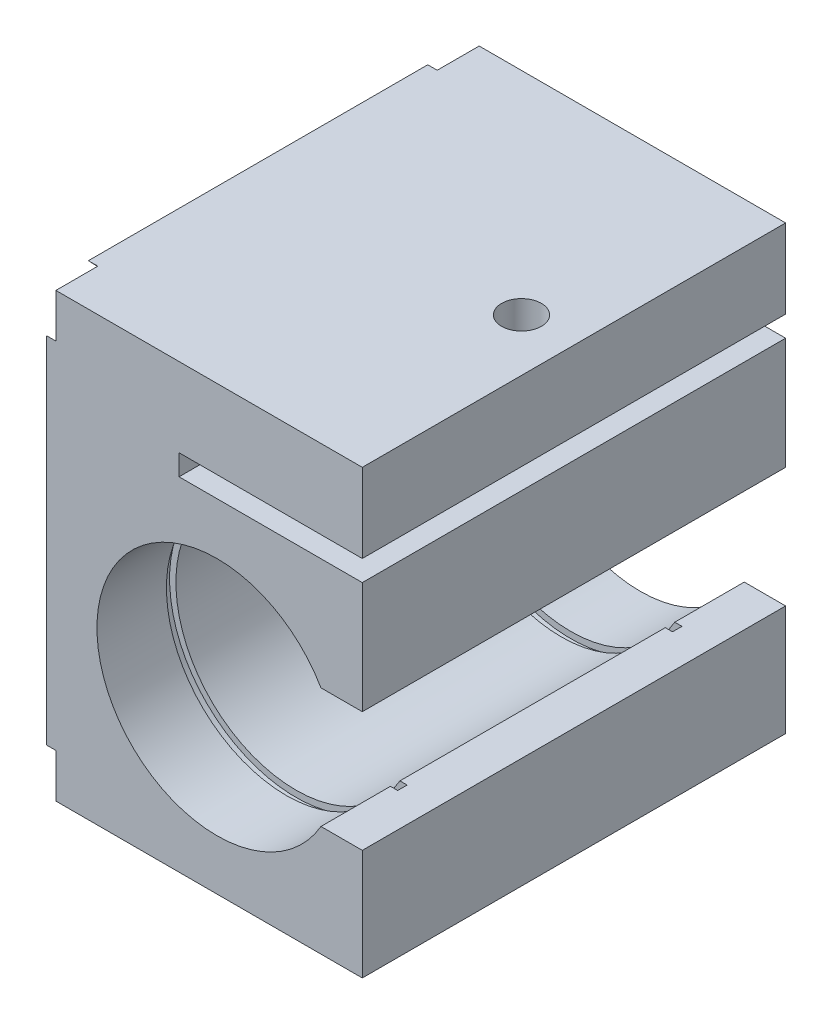
ISO-10303-21;
HEADER;
FILE_DESCRIPTION(('STEP AP214'),'2;1');
FILE_NAME('part.step','',(''),(''),'','','');
FILE_SCHEMA(('AUTOMOTIVE_DESIGN { 1 0 10303 214 1 1 1 1 }'));
ENDSEC;
DATA;
#1=APPLICATION_CONTEXT('core data for automotive mechanical design processes');
#2=APPLICATION_PROTOCOL_DEFINITION('international standard','automotive_design',2000,#1);
#3=PRODUCT_CONTEXT('',#1,'mechanical');
#4=PRODUCT('Part','Part','',(#3));
#5=PRODUCT_RELATED_PRODUCT_CATEGORY('part','',(#4));
#6=PRODUCT_DEFINITION_FORMATION('','',#4);
#7=PRODUCT_DEFINITION_CONTEXT('part definition',#1,'design');
#8=PRODUCT_DEFINITION('design','',#6,#7);
#9=PRODUCT_DEFINITION_SHAPE('','',#8);
#10=(LENGTH_UNIT() NAMED_UNIT(*) SI_UNIT(.MILLI.,.METRE.));
#11=(NAMED_UNIT(*) PLANE_ANGLE_UNIT() SI_UNIT($,.RADIAN.));
#12=(NAMED_UNIT(*) SI_UNIT($,.STERADIAN.) SOLID_ANGLE_UNIT());
#13=UNCERTAINTY_MEASURE_WITH_UNIT(LENGTH_MEASURE(1.E-05),#10,'distance_accuracy_value','');
#14=(GEOMETRIC_REPRESENTATION_CONTEXT(3) GLOBAL_UNCERTAINTY_ASSIGNED_CONTEXT((#13)) GLOBAL_UNIT_ASSIGNED_CONTEXT((#10,
#11,#12)) REPRESENTATION_CONTEXT('',''));
#15=CARTESIAN_POINT('',(0.,0.,0.));
#16=DIRECTION('',(0.,0.,1.));
#17=DIRECTION('',(1.,0.,0.));
#18=AXIS2_PLACEMENT_3D('',#15,#16,#17);
#19=CARTESIAN_POINT('',(1.99999999999999,-8.00000000000001,0.));
#20=DIRECTION('',(0.,0.,1.));
#21=DIRECTION('',(1.,0.,0.));
#22=AXIS2_PLACEMENT_3D('',#19,#20,#21);
#23=CYLINDRICAL_SURFACE('',#22,19.);
#24=CARTESIAN_POINT('',(1.99999999999999,-8.00000000000001,12.5));
#25=DIRECTION('',(0.,0.,-1.));
#26=DIRECTION('',(-1.,0.,0.));
#27=AXIS2_PLACEMENT_3D('',#24,#25,#26);
#28=CIRCLE('',#27,19.);
#29=CARTESIAN_POINT('',(18.4544826719043,1.49999999999999,12.5));
#30=VERTEX_POINT('',#29);
#31=CARTESIAN_POINT('',(18.4544826719043,-17.5,12.5));
#32=VERTEX_POINT('',#31);
#33=EDGE_CURVE('E59',#30,#32,#28,.F.);
#34=ORIENTED_EDGE('',*,*,#33,.F.);
#35=DIRECTION('',(0.,0.,1.));
#36=VECTOR('',#35,1.);
#37=CARTESIAN_POINT('',(18.4544826719043,1.49999999999999,0.));
#38=LINE('',#37,#36);
#39=CARTESIAN_POINT('',(18.4544826719043,1.49999999999999,54.5));
#40=VERTEX_POINT('',#39);
#41=EDGE_CURVE('E276',#30,#40,#38,.T.);
#42=ORIENTED_EDGE('',*,*,#41,.T.);
#43=CARTESIAN_POINT('',(1.99999999999999,-8.00000000000001,54.5));
#44=DIRECTION('',(0.,0.,1.));
#45=DIRECTION('',(1.,0.,0.));
#46=AXIS2_PLACEMENT_3D('',#43,#44,#45);
#47=CIRCLE('',#46,19.);
#48=CARTESIAN_POINT('',(18.4544826719043,-17.5,54.5));
#49=VERTEX_POINT('',#48);
#50=EDGE_CURVE('E292',#49,#40,#47,.F.);
#51=ORIENTED_EDGE('',*,*,#50,.F.);
#52=DIRECTION('',(0.,0.,1.));
#53=VECTOR('',#52,1.);
#54=CARTESIAN_POINT('',(18.4544826719043,-17.5,0.));
#55=LINE('',#54,#53);
#56=EDGE_CURVE('E481',#32,#49,#55,.T.);
#57=ORIENTED_EDGE('',*,*,#56,.F.);
#58=EDGE_LOOP('',(#34,#42,#51,#57));
#59=FACE_BOUND('',#58,.T.);
#60=ADVANCED_FACE('F43',(#59),#23,.F.);
#61=CARTESIAN_POINT('',(18.4544826719043,1.49999999999999,0.));
#62=VERTEX_POINT('',#61);
#63=CARTESIAN_POINT('',(18.4544826719043,1.49999999999999,11.));
#64=VERTEX_POINT('',#63);
#65=EDGE_CURVE('E490',#62,#64,#38,.T.);
#66=ORIENTED_EDGE('',*,*,#65,.T.);
#67=CARTESIAN_POINT('',(1.99999999999999,-8.00000000000001,11.));
#68=DIRECTION('',(0.,0.,-1.));
#69=DIRECTION('',(-1.,0.,0.));
#70=AXIS2_PLACEMENT_3D('',#67,#68,#69);
#71=CIRCLE('',#70,19.);
#72=CARTESIAN_POINT('',(18.4544826719043,-17.5,11.));
#73=VERTEX_POINT('',#72);
#74=EDGE_CURVE('E278',#64,#73,#71,.F.);
#75=ORIENTED_EDGE('',*,*,#74,.T.);
#76=CARTESIAN_POINT('',(18.4544826719043,-17.5,0.));
#77=VERTEX_POINT('',#76);
#78=EDGE_CURVE('E476',#77,#73,#55,.T.);
#79=ORIENTED_EDGE('',*,*,#78,.F.);
#80=CARTESIAN_POINT('',(1.99999999999999,-8.00000000000001,0.));
#81=DIRECTION('',(0.,0.,1.));
#82=DIRECTION('',(1.,0.,0.));
#83=AXIS2_PLACEMENT_3D('',#80,#81,#82);
#84=CIRCLE('',#83,19.);
#85=EDGE_CURVE('E499',#62,#77,#84,.T.);
#86=ORIENTED_EDGE('',*,*,#85,.F.);
#87=EDGE_LOOP('',(#66,#75,#79,#86));
#88=FACE_BOUND('',#87,.T.);
#89=ADVANCED_FACE('F585',(#88),#23,.F.);
#90=CARTESIAN_POINT('',(-25.,35.,67.));
#91=DIRECTION('',(0.,-1.,0.));
#92=DIRECTION('',(0.,0.,-1.));
#93=AXIS2_PLACEMENT_3D('',#90,#91,#92);
#94=PLANE('',#93);
#95=CARTESIAN_POINT('',(16.7,35.,33.5));
#96=DIRECTION('',(0.,1.,0.));
#97=DIRECTION('',(0.,0.,1.));
#98=AXIS2_PLACEMENT_3D('',#95,#96,#97);
#99=CIRCLE('',#98,3.15);
#100=CARTESIAN_POINT('',(16.7,35.,36.65));
#101=VERTEX_POINT('',#100);
#102=EDGE_CURVE('E312',#101,#101,#99,.T.);
#103=ORIENTED_EDGE('',*,*,#102,.F.);
#104=EDGE_LOOP('',(#103));
#105=FACE_BOUND('',#104,.T.);
#106=DIRECTION('',(-1.,0.,0.));
#107=VECTOR('',#106,1.);
#108=CARTESIAN_POINT('',(-23.5,35.,60.355644408636));
#109=LINE('',#108,#107);
#110=CARTESIAN_POINT('',(-23.5,35.,60.355644408636));
#111=VERTEX_POINT('',#110);
#112=CARTESIAN_POINT('',(-25.,35.,60.355644408636));
#113=VERTEX_POINT('',#112);
#114=EDGE_CURVE('E428',#111,#113,#109,.T.);
#115=ORIENTED_EDGE('',*,*,#114,.F.);
#116=DIRECTION('',(0.,0.,-1.));
#117=VECTOR('',#116,1.);
#118=CARTESIAN_POINT('',(-23.5,35.,0.));
#119=LINE('',#118,#117);
#120=CARTESIAN_POINT('',(-23.5,35.,67.));
#121=VERTEX_POINT('',#120);
#122=EDGE_CURVE('E332',#121,#111,#119,.T.);
#123=ORIENTED_EDGE('',*,*,#122,.F.);
#124=DIRECTION('',(-1.,0.,0.));
#125=VECTOR('',#124,1.);
#126=CARTESIAN_POINT('',(-25.,35.,67.));
#127=LINE('',#126,#125);
#128=CARTESIAN_POINT('',(25.,35.,67.));
#129=VERTEX_POINT('',#128);
#130=EDGE_CURVE('E519',#129,#121,#127,.T.);
#131=ORIENTED_EDGE('',*,*,#130,.F.);
#132=DIRECTION('',(0.,0.,-1.));
#133=VECTOR('',#132,1.);
#134=CARTESIAN_POINT('',(25.,35.,67.));
#135=LINE('',#134,#133);
#136=CARTESIAN_POINT('',(25.,35.,0.));
#137=VERTEX_POINT('',#136);
#138=EDGE_CURVE('E560',#129,#137,#135,.T.);
#139=ORIENTED_EDGE('',*,*,#138,.T.);
#140=DIRECTION('',(-1.,0.,0.));
#141=VECTOR('',#140,1.);
#142=CARTESIAN_POINT('',(-25.,35.,0.));
#143=LINE('',#142,#141);
#144=CARTESIAN_POINT('',(-23.5,35.,0.));
#145=VERTEX_POINT('',#144);
#146=EDGE_CURVE('E537',#137,#145,#143,.T.);
#147=ORIENTED_EDGE('',*,*,#146,.T.);
#148=CARTESIAN_POINT('',(-23.5,35.,6.64435559136401));
#149=VERTEX_POINT('',#148);
#150=EDGE_CURVE('E338',#149,#145,#119,.T.);
#151=ORIENTED_EDGE('',*,*,#150,.F.);
#152=DIRECTION('',(-1.,0.,0.));
#153=VECTOR('',#152,1.);
#154=CARTESIAN_POINT('',(-23.5,35.,6.64435559136401));
#155=LINE('',#154,#153);
#156=CARTESIAN_POINT('',(-25.,35.,6.64435559136401));
#157=VERTEX_POINT('',#156);
#158=EDGE_CURVE('E421',#149,#157,#155,.T.);
#159=ORIENTED_EDGE('',*,*,#158,.T.);
#160=DIRECTION('',(0.,0.,-1.));
#161=VECTOR('',#160,1.);
#162=CARTESIAN_POINT('',(-25.,35.,67.));
#163=LINE('',#162,#161);
#164=EDGE_CURVE('E556',#113,#157,#163,.T.);
#165=ORIENTED_EDGE('',*,*,#164,.F.);
#166=EDGE_LOOP('',(#115,#123,#131,#139,#147,#151,#159,#165));
#167=FACE_BOUND('',#166,.T.);
#168=ADVANCED_FACE('F615',(#105,#167),#94,.F.);
#169=CARTESIAN_POINT('',(-25.,-35.,67.));
#170=DIRECTION('',(1.,0.,0.));
#171=DIRECTION('',(0.,0.,-1.));
#172=AXIS2_PLACEMENT_3D('',#169,#170,#171);
#173=PLANE('',#172);
#174=DIRECTION('',(0.,0.722417687313246,0.691456929285535));
#175=VECTOR('',#174,1.);
#176=CARTESIAN_POINT('',(-25.,-13.4149507164238,14.0156201514875));
#177=LINE('',#176,#175);
#178=CARTESIAN_POINT('',(-25.,-28.0581359493212,0.));
#179=VERTEX_POINT('',#178);
#180=CARTESIAN_POINT('',(-25.,0.,26.855644408636));
#181=VERTEX_POINT('',#180);
#182=EDGE_CURVE('E387',#179,#181,#177,.T.);
#183=ORIENTED_EDGE('',*,*,#182,.T.);
#184=DIRECTION('',(0.,-0.722417687313246,0.691456929285535));
#185=VECTOR('',#184,1.);
#186=CARTESIAN_POINT('',(-25.,13.4149507164238,14.0156201514875));
#187=LINE('',#186,#185);
#188=CARTESIAN_POINT('',(-25.,28.0581359493212,0.));
#189=VERTEX_POINT('',#188);
#190=EDGE_CURVE('E383',#189,#181,#187,.T.);
#191=ORIENTED_EDGE('',*,*,#190,.F.);
#192=DIRECTION('',(0.,-1.,0.));
#193=VECTOR('',#192,1.);
#194=CARTESIAN_POINT('',(-25.,-35.,0.));
#195=LINE('',#194,#193);
#196=EDGE_CURVE('E542',#189,#179,#195,.T.);
#197=ORIENTED_EDGE('',*,*,#196,.T.);
#198=EDGE_LOOP('',(#183,#191,#197));
#199=FACE_BOUND('',#198,.T.);
#200=ADVANCED_FACE('F690',(#199),#173,.F.);
#201=DIRECTION('',(0.,-0.722417687313246,0.691456929285535));
#202=VECTOR('',#201,1.);
#203=CARTESIAN_POINT('',(-25.,20.0529372375649,20.9508299496947));
#204=LINE('',#203,#202);
#205=CARTESIAN_POINT('',(-25.,6.94186405067879,33.5));
#206=VERTEX_POINT('',#205);
#207=EDGE_CURVE('E379',#157,#206,#204,.T.);
#208=ORIENTED_EDGE('',*,*,#207,.T.);
#209=DIRECTION('',(0.,0.722417687313245,0.691456929285535));
#210=VECTOR('',#209,1.);
#211=CARTESIAN_POINT('',(-25.,-13.4149507164238,14.0156201514875));
#212=LINE('',#211,#210);
#213=EDGE_CURVE('E375',#206,#113,#212,.T.);
#214=ORIENTED_EDGE('',*,*,#213,.T.);
#215=ORIENTED_EDGE('',*,*,#164,.T.);
#216=EDGE_LOOP('',(#208,#214,#215));
#217=FACE_BOUND('',#216,.T.);
#218=ADVANCED_FACE('F692',(#217),#173,.F.);
#219=DIRECTION('',(0.,-0.722417687313246,0.691456929285535));
#220=VECTOR('',#219,1.);
#221=CARTESIAN_POINT('',(-25.,20.0529372375649,20.9508299496947));
#222=LINE('',#221,#220);
#223=CARTESIAN_POINT('',(-25.,0.,40.144355591364));
#224=VERTEX_POINT('',#223);
#225=CARTESIAN_POINT('',(-25.,-28.0581359493212,67.));
#226=VERTEX_POINT('',#225);
#227=EDGE_CURVE('E320',#224,#226,#222,.T.);
#228=ORIENTED_EDGE('',*,*,#227,.T.);
#229=DIRECTION('',(0.,-1.,0.));
#230=VECTOR('',#229,1.);
#231=CARTESIAN_POINT('',(-25.,-35.,67.));
#232=LINE('',#231,#230);
#233=CARTESIAN_POINT('',(-25.,28.0581359493212,67.));
#234=VERTEX_POINT('',#233);
#235=EDGE_CURVE('E525',#234,#226,#232,.T.);
#236=ORIENTED_EDGE('',*,*,#235,.F.);
#237=DIRECTION('',(0.,0.722417687313246,0.691456929285535));
#238=VECTOR('',#237,1.);
#239=CARTESIAN_POINT('',(-25.,-20.0529372375649,20.9508299496947));
#240=LINE('',#239,#238);
#241=EDGE_CURVE('E372',#224,#234,#240,.T.);
#242=ORIENTED_EDGE('',*,*,#241,.F.);
#243=EDGE_LOOP('',(#228,#236,#242));
#244=FACE_BOUND('',#243,.T.);
#245=ADVANCED_FACE('F698',(#244),#173,.F.);
#246=CARTESIAN_POINT('',(0.,0.,67.));
#247=DIRECTION('',(0.,0.,-1.));
#248=DIRECTION('',(-1.,0.,0.));
#249=AXIS2_PLACEMENT_3D('',#246,#247,#248);
#250=PLANE('',#249);
#251=DIRECTION('',(-1.,0.,0.));
#252=VECTOR('',#251,1.);
#253=CARTESIAN_POINT('',(-23.5,-28.0581359493212,67.));
#254=LINE('',#253,#252);
#255=CARTESIAN_POINT('',(-23.5,-28.0581359493212,67.));
#256=VERTEX_POINT('',#255);
#257=EDGE_CURVE('E397',#256,#226,#254,.T.);
#258=ORIENTED_EDGE('',*,*,#257,.F.);
#259=DIRECTION('',(0.,1.,0.));
#260=VECTOR('',#259,1.);
#261=CARTESIAN_POINT('',(-23.5,0.,67.));
#262=LINE('',#261,#260);
#263=CARTESIAN_POINT('',(-23.5,-35.,67.));
#264=VERTEX_POINT('',#263);
#265=EDGE_CURVE('E333',#264,#256,#262,.T.);
#266=ORIENTED_EDGE('',*,*,#265,.F.);
#267=DIRECTION('',(1.,0.,0.));
#268=VECTOR('',#267,1.);
#269=CARTESIAN_POINT('',(-25.,-35.,67.));
#270=LINE('',#269,#268);
#271=CARTESIAN_POINT('',(25.,-35.,67.));
#272=VERTEX_POINT('',#271);
#273=EDGE_CURVE('E529',#264,#272,#270,.T.);
#274=ORIENTED_EDGE('',*,*,#273,.T.);
#275=DIRECTION('',(0.,1.,0.));
#276=VECTOR('',#275,1.);
#277=CARTESIAN_POINT('',(25.,-35.,67.));
#278=LINE('',#277,#276);
#279=CARTESIAN_POINT('',(25.,-17.5,67.));
#280=VERTEX_POINT('',#279);
#281=EDGE_CURVE('E515',#272,#280,#278,.T.);
#282=ORIENTED_EDGE('',*,*,#281,.T.);
#283=DIRECTION('',(1.,0.,0.));
#284=VECTOR('',#283,1.);
#285=CARTESIAN_POINT('',(18.4544826719043,-17.5,67.));
#286=LINE('',#285,#284);
#287=CARTESIAN_POINT('',(18.4544826719043,-17.5,67.));
#288=VERTEX_POINT('',#287);
#289=EDGE_CURVE('E498',#288,#280,#286,.T.);
#290=ORIENTED_EDGE('',*,*,#289,.F.);
#291=CARTESIAN_POINT('',(1.99999999999999,-8.00000000000001,67.));
#292=DIRECTION('',(0.,0.,1.));
#293=DIRECTION('',(1.,0.,0.));
#294=AXIS2_PLACEMENT_3D('',#291,#292,#293);
#295=CIRCLE('',#294,19.);
#296=CARTESIAN_POINT('',(18.4544826719043,1.49999999999999,67.));
#297=VERTEX_POINT('',#296);
#298=EDGE_CURVE('E457',#297,#288,#295,.T.);
#299=ORIENTED_EDGE('',*,*,#298,.F.);
#300=DIRECTION('',(-1.,0.,0.));
#301=VECTOR('',#300,1.);
#302=CARTESIAN_POINT('',(18.4544826719043,1.49999999999999,67.));
#303=LINE('',#302,#301);
#304=CARTESIAN_POINT('',(25.,1.49999999999999,67.));
#305=VERTEX_POINT('',#304);
#306=EDGE_CURVE('E494',#305,#297,#303,.T.);
#307=ORIENTED_EDGE('',*,*,#306,.F.);
#308=CARTESIAN_POINT('',(25.,19.2,67.));
#309=VERTEX_POINT('',#308);
#310=EDGE_CURVE('E520',#305,#309,#278,.T.);
#311=ORIENTED_EDGE('',*,*,#310,.T.);
#312=DIRECTION('',(1.,0.,0.));
#313=VECTOR('',#312,1.);
#314=CARTESIAN_POINT('',(25.,19.2,67.));
#315=LINE('',#314,#313);
#316=CARTESIAN_POINT('',(-4.00000000000001,19.2,67.));
#317=VERTEX_POINT('',#316);
#318=EDGE_CURVE('E443',#317,#309,#315,.T.);
#319=ORIENTED_EDGE('',*,*,#318,.F.);
#320=DIRECTION('',(0.,-1.,0.));
#321=VECTOR('',#320,1.);
#322=CARTESIAN_POINT('',(-4.00000000000001,22.5,67.));
#323=LINE('',#322,#321);
#324=CARTESIAN_POINT('',(-4.00000000000001,22.5,67.));
#325=VERTEX_POINT('',#324);
#326=EDGE_CURVE('E456',#325,#317,#323,.T.);
#327=ORIENTED_EDGE('',*,*,#326,.F.);
#328=DIRECTION('',(-1.,0.,0.));
#329=VECTOR('',#328,1.);
#330=CARTESIAN_POINT('',(25.,22.5,67.));
#331=LINE('',#330,#329);
#332=CARTESIAN_POINT('',(25.,22.5,67.));
#333=VERTEX_POINT('',#332);
#334=EDGE_CURVE('E452',#333,#325,#331,.T.);
#335=ORIENTED_EDGE('',*,*,#334,.F.);
#336=EDGE_CURVE('E521',#333,#129,#278,.T.);
#337=ORIENTED_EDGE('',*,*,#336,.T.);
#338=ORIENTED_EDGE('',*,*,#130,.T.);
#339=CARTESIAN_POINT('',(-23.5,28.0581359493212,67.));
#340=VERTEX_POINT('',#339);
#341=EDGE_CURVE('E329',#340,#121,#262,.T.);
#342=ORIENTED_EDGE('',*,*,#341,.F.);
#343=DIRECTION('',(-1.,0.,0.));
#344=VECTOR('',#343,1.);
#345=CARTESIAN_POINT('',(-23.5,28.0581359493212,67.));
#346=LINE('',#345,#344);
#347=EDGE_CURVE('E431',#340,#234,#346,.T.);
#348=ORIENTED_EDGE('',*,*,#347,.T.);
#349=ORIENTED_EDGE('',*,*,#235,.T.);
#350=EDGE_LOOP('',(#258,#266,#274,#282,#290,#299,#307,#311,#319,#327,#335,#337,#338,#342,#348,#349));
#351=FACE_BOUND('',#350,.T.);
#352=ADVANCED_FACE('F606',(#351),#250,.F.);
#353=CARTESIAN_POINT('',(0.,0.,0.));
#354=DIRECTION('',(0.,0.,-1.));
#355=DIRECTION('',(-1.,0.,0.));
#356=AXIS2_PLACEMENT_3D('',#353,#354,#355);
#357=PLANE('',#356);
#358=DIRECTION('',(0.,-1.,0.));
#359=VECTOR('',#358,1.);
#360=CARTESIAN_POINT('',(-23.5,0.,0.));
#361=LINE('',#360,#359);
#362=CARTESIAN_POINT('',(-23.5,-28.0581359493212,0.));
#363=VERTEX_POINT('',#362);
#364=CARTESIAN_POINT('',(-23.5,-35.,0.));
#365=VERTEX_POINT('',#364);
#366=EDGE_CURVE('E349',#363,#365,#361,.T.);
#367=ORIENTED_EDGE('',*,*,#366,.F.);
#368=DIRECTION('',(-1.,0.,0.));
#369=VECTOR('',#368,1.);
#370=CARTESIAN_POINT('',(-23.5,-28.0581359493212,0.));
#371=LINE('',#370,#369);
#372=EDGE_CURVE('E411',#363,#179,#371,.T.);
#373=ORIENTED_EDGE('',*,*,#372,.T.);
#374=ORIENTED_EDGE('',*,*,#196,.F.);
#375=DIRECTION('',(-1.,0.,0.));
#376=VECTOR('',#375,1.);
#377=CARTESIAN_POINT('',(-23.5,28.0581359493212,0.));
#378=LINE('',#377,#376);
#379=CARTESIAN_POINT('',(-23.5,28.0581359493212,0.));
#380=VERTEX_POINT('',#379);
#381=EDGE_CURVE('E418',#380,#189,#378,.T.);
#382=ORIENTED_EDGE('',*,*,#381,.F.);
#383=EDGE_CURVE('E344',#145,#380,#361,.T.);
#384=ORIENTED_EDGE('',*,*,#383,.F.);
#385=ORIENTED_EDGE('',*,*,#146,.F.);
#386=DIRECTION('',(0.,1.,0.));
#387=VECTOR('',#386,1.);
#388=CARTESIAN_POINT('',(25.,-35.,0.));
#389=LINE('',#388,#387);
#390=CARTESIAN_POINT('',(25.,22.5,0.));
#391=VERTEX_POINT('',#390);
#392=EDGE_CURVE('E467',#391,#137,#389,.T.);
#393=ORIENTED_EDGE('',*,*,#392,.F.);
#394=DIRECTION('',(-1.,0.,0.));
#395=VECTOR('',#394,1.);
#396=CARTESIAN_POINT('',(25.,22.5,0.));
#397=LINE('',#396,#395);
#398=CARTESIAN_POINT('',(-4.00000000000001,22.5,0.));
#399=VERTEX_POINT('',#398);
#400=EDGE_CURVE('E438',#391,#399,#397,.T.);
#401=ORIENTED_EDGE('',*,*,#400,.T.);
#402=DIRECTION('',(0.,-1.,0.));
#403=VECTOR('',#402,1.);
#404=CARTESIAN_POINT('',(-4.00000000000001,22.5,0.));
#405=LINE('',#404,#403);
#406=CARTESIAN_POINT('',(-4.00000000000001,19.2,0.));
#407=VERTEX_POINT('',#406);
#408=EDGE_CURVE('E442',#399,#407,#405,.T.);
#409=ORIENTED_EDGE('',*,*,#408,.T.);
#410=DIRECTION('',(1.,0.,0.));
#411=VECTOR('',#410,1.);
#412=CARTESIAN_POINT('',(25.,19.2,0.));
#413=LINE('',#412,#411);
#414=CARTESIAN_POINT('',(25.,19.2,0.));
#415=VERTEX_POINT('',#414);
#416=EDGE_CURVE('E447',#407,#415,#413,.T.);
#417=ORIENTED_EDGE('',*,*,#416,.T.);
#418=CARTESIAN_POINT('',(25.,1.49999999999999,0.));
#419=VERTEX_POINT('',#418);
#420=EDGE_CURVE('E538',#419,#415,#389,.T.);
#421=ORIENTED_EDGE('',*,*,#420,.F.);
#422=DIRECTION('',(-1.,0.,0.));
#423=VECTOR('',#422,1.);
#424=CARTESIAN_POINT('',(18.4544826719043,1.49999999999999,0.));
#425=LINE('',#424,#423);
#426=EDGE_CURVE('E480',#419,#62,#425,.T.);
#427=ORIENTED_EDGE('',*,*,#426,.T.);
#428=ORIENTED_EDGE('',*,*,#85,.T.);
#429=DIRECTION('',(1.,0.,0.));
#430=VECTOR('',#429,1.);
#431=CARTESIAN_POINT('',(18.4544826719043,-17.5,0.));
#432=LINE('',#431,#430);
#433=CARTESIAN_POINT('',(25.,-17.5,0.));
#434=VERTEX_POINT('',#433);
#435=EDGE_CURVE('E508',#77,#434,#432,.T.);
#436=ORIENTED_EDGE('',*,*,#435,.T.);
#437=CARTESIAN_POINT('',(25.,-35.,0.));
#438=VERTEX_POINT('',#437);
#439=EDGE_CURVE('E533',#438,#434,#389,.T.);
#440=ORIENTED_EDGE('',*,*,#439,.F.);
#441=DIRECTION('',(1.,0.,0.));
#442=VECTOR('',#441,1.);
#443=CARTESIAN_POINT('',(-25.,-35.,0.));
#444=LINE('',#443,#442);
#445=EDGE_CURVE('E546',#365,#438,#444,.T.);
#446=ORIENTED_EDGE('',*,*,#445,.F.);
#447=EDGE_LOOP('',(#367,#373,#374,#382,#384,#385,#393,#401,#409,#417,#421,#427,#428,#436,#440,#446));
#448=FACE_BOUND('',#447,.T.);
#449=ADVANCED_FACE('F590',(#448),#357,.T.);
#450=CARTESIAN_POINT('',(25.,-35.,67.));
#451=DIRECTION('',(-1.,0.,0.));
#452=DIRECTION('',(0.,0.,1.));
#453=AXIS2_PLACEMENT_3D('',#450,#451,#452);
#454=PLANE('',#453);
#455=ORIENTED_EDGE('',*,*,#420,.T.);
#456=DIRECTION('',(0.,0.,1.));
#457=VECTOR('',#456,1.);
#458=CARTESIAN_POINT('',(25.,19.2,0.));
#459=LINE('',#458,#457);
#460=EDGE_CURVE('E463',#415,#309,#459,.T.);
#461=ORIENTED_EDGE('',*,*,#460,.T.);
#462=ORIENTED_EDGE('',*,*,#310,.F.);
#463=DIRECTION('',(0.,0.,1.));
#464=VECTOR('',#463,1.);
#465=CARTESIAN_POINT('',(25.,1.49999999999999,0.));
#466=LINE('',#465,#464);
#467=EDGE_CURVE('E487',#419,#305,#466,.T.);
#468=ORIENTED_EDGE('',*,*,#467,.F.);
#469=EDGE_LOOP('',(#455,#461,#462,#468));
#470=FACE_BOUND('',#469,.T.);
#471=ADVANCED_FACE('F596',(#470),#454,.F.);
#472=ORIENTED_EDGE('',*,*,#336,.F.);
#473=DIRECTION('',(0.,0.,1.));
#474=VECTOR('',#473,1.);
#475=CARTESIAN_POINT('',(25.,22.5,0.));
#476=LINE('',#475,#474);
#477=EDGE_CURVE('E451',#391,#333,#476,.T.);
#478=ORIENTED_EDGE('',*,*,#477,.F.);
#479=ORIENTED_EDGE('',*,*,#392,.T.);
#480=ORIENTED_EDGE('',*,*,#138,.F.);
#481=EDGE_LOOP('',(#472,#478,#479,#480));
#482=FACE_BOUND('',#481,.T.);
#483=ADVANCED_FACE('F616',(#482),#454,.F.);
#484=ORIENTED_EDGE('',*,*,#439,.T.);
#485=DIRECTION('',(0.,0.,1.));
#486=VECTOR('',#485,1.);
#487=CARTESIAN_POINT('',(25.,-17.5,0.));
#488=LINE('',#487,#486);
#489=EDGE_CURVE('E483',#434,#280,#488,.T.);
#490=ORIENTED_EDGE('',*,*,#489,.T.);
#491=ORIENTED_EDGE('',*,*,#281,.F.);
#492=DIRECTION('',(0.,0.,-1.));
#493=VECTOR('',#492,1.);
#494=CARTESIAN_POINT('',(25.,-35.,67.));
#495=LINE('',#494,#493);
#496=EDGE_CURVE('E532',#272,#438,#495,.T.);
#497=ORIENTED_EDGE('',*,*,#496,.T.);
#498=EDGE_LOOP('',(#484,#490,#491,#497));
#499=FACE_BOUND('',#498,.T.);
#500=ADVANCED_FACE('F45',(#499),#454,.F.);
#501=DIRECTION('',(0.,0.,-1.));
#502=VECTOR('',#501,1.);
#503=CARTESIAN_POINT('',(-25.,-35.,67.));
#504=LINE('',#503,#502);
#505=CARTESIAN_POINT('',(-25.,-35.,60.355644408636));
#506=VERTEX_POINT('',#505);
#507=CARTESIAN_POINT('',(-25.,-35.,6.64435559136398));
#508=VERTEX_POINT('',#507);
#509=EDGE_CURVE('E552',#506,#508,#504,.T.);
#510=ORIENTED_EDGE('',*,*,#509,.F.);
#511=DIRECTION('',(0.,-0.722417687313246,0.691456929285535));
#512=VECTOR('',#511,1.);
#513=CARTESIAN_POINT('',(-25.,13.4149507164238,14.0156201514875));
#514=LINE('',#513,#512);
#515=CARTESIAN_POINT('',(-25.,-6.94186405067879,33.5));
#516=VERTEX_POINT('',#515);
#517=EDGE_CURVE('E325',#516,#506,#514,.T.);
#518=ORIENTED_EDGE('',*,*,#517,.F.);
#519=DIRECTION('',(0.,0.722417687313246,0.691456929285535));
#520=VECTOR('',#519,1.);
#521=CARTESIAN_POINT('',(-25.,-20.0529372375649,20.9508299496947));
#522=LINE('',#521,#520);
#523=EDGE_CURVE('E391',#508,#516,#522,.T.);
#524=ORIENTED_EDGE('',*,*,#523,.F.);
#525=EDGE_LOOP('',(#510,#518,#524));
#526=FACE_BOUND('',#525,.T.);
#527=ADVANCED_FACE('F657',(#526),#173,.F.);
#528=CARTESIAN_POINT('',(-25.,-35.,67.));
#529=DIRECTION('',(0.,1.,0.));
#530=DIRECTION('',(0.,0.,1.));
#531=AXIS2_PLACEMENT_3D('',#528,#529,#530);
#532=PLANE('',#531);
#533=ORIENTED_EDGE('',*,*,#509,.T.);
#534=DIRECTION('',(-1.,0.,0.));
#535=VECTOR('',#534,1.);
#536=CARTESIAN_POINT('',(-23.5,-35.,6.64435559136398));
#537=LINE('',#536,#535);
#538=CARTESIAN_POINT('',(-23.5,-35.,6.64435559136398));
#539=VERTEX_POINT('',#538);
#540=EDGE_CURVE('E408',#539,#508,#537,.T.);
#541=ORIENTED_EDGE('',*,*,#540,.F.);
#542=DIRECTION('',(0.,0.,1.));
#543=VECTOR('',#542,1.);
#544=CARTESIAN_POINT('',(-23.5,-35.,0.));
#545=LINE('',#544,#543);
#546=EDGE_CURVE('E356',#365,#539,#545,.T.);
#547=ORIENTED_EDGE('',*,*,#546,.F.);
#548=ORIENTED_EDGE('',*,*,#445,.T.);
#549=ORIENTED_EDGE('',*,*,#496,.F.);
#550=ORIENTED_EDGE('',*,*,#273,.F.);
#551=CARTESIAN_POINT('',(-23.5,-35.,60.355644408636));
#552=VERTEX_POINT('',#551);
#553=EDGE_CURVE('E361',#552,#264,#545,.T.);
#554=ORIENTED_EDGE('',*,*,#553,.F.);
#555=DIRECTION('',(-1.,0.,0.));
#556=VECTOR('',#555,1.);
#557=CARTESIAN_POINT('',(-23.5,-35.,60.355644408636));
#558=LINE('',#557,#556);
#559=EDGE_CURVE('E401',#552,#506,#558,.T.);
#560=ORIENTED_EDGE('',*,*,#559,.T.);
#561=EDGE_LOOP('',(#533,#541,#547,#548,#549,#550,#554,#560));
#562=FACE_BOUND('',#561,.T.);
#563=ADVANCED_FACE('F650',(#562),#532,.F.);
#564=CARTESIAN_POINT('',(18.4544826719043,-17.5,56.));
#565=VERTEX_POINT('',#564);
#566=EDGE_CURVE('E482',#565,#288,#55,.T.);
#567=ORIENTED_EDGE('',*,*,#566,.F.);
#568=CARTESIAN_POINT('',(1.99999999999999,-8.00000000000001,56.));
#569=DIRECTION('',(0.,0.,1.));
#570=DIRECTION('',(1.,0.,0.));
#571=AXIS2_PLACEMENT_3D('',#568,#569,#570);
#572=CIRCLE('',#571,19.);
#573=CARTESIAN_POINT('',(18.4544826719043,1.49999999999999,56.));
#574=VERTEX_POINT('',#573);
#575=EDGE_CURVE('E301',#565,#574,#572,.F.);
#576=ORIENTED_EDGE('',*,*,#575,.T.);
#577=EDGE_CURVE('E400',#574,#297,#38,.T.);
#578=ORIENTED_EDGE('',*,*,#577,.T.);
#579=ORIENTED_EDGE('',*,*,#298,.T.);
#580=EDGE_LOOP('',(#567,#576,#578,#579));
#581=FACE_BOUND('',#580,.T.);
#582=ADVANCED_FACE('F643',(#581),#23,.F.);
#583=CARTESIAN_POINT('',(18.4544826719043,1.49999999999999,0.));
#584=DIRECTION('',(0.,1.,0.));
#585=DIRECTION('',(0.,0.,1.));
#586=AXIS2_PLACEMENT_3D('',#583,#584,#585);
#587=PLANE('',#586);
#588=DIRECTION('',(0.,0.,1.));
#589=VECTOR('',#588,1.);
#590=CARTESIAN_POINT('',(19.599715906798,1.49999999999999,11.));
#591=LINE('',#590,#589);
#592=CARTESIAN_POINT('',(19.599715906798,1.49999999999999,12.5));
#593=VERTEX_POINT('',#592);
#594=CARTESIAN_POINT('',(19.599715906798,1.49999999999999,11.));
#595=VERTEX_POINT('',#594);
#596=EDGE_CURVE('E255',#593,#595,#591,.F.);
#597=ORIENTED_EDGE('',*,*,#596,.T.);
#598=DIRECTION('',(-1.,0.,0.));
#599=VECTOR('',#598,1.);
#600=CARTESIAN_POINT('',(18.4544826719043,1.49999999999999,11.));
#601=LINE('',#600,#599);
#602=EDGE_CURVE('E266',#595,#64,#601,.T.);
#603=ORIENTED_EDGE('',*,*,#602,.T.);
#604=ORIENTED_EDGE('',*,*,#65,.F.);
#605=ORIENTED_EDGE('',*,*,#426,.F.);
#606=ORIENTED_EDGE('',*,*,#467,.T.);
#607=ORIENTED_EDGE('',*,*,#306,.T.);
#608=ORIENTED_EDGE('',*,*,#577,.F.);
#609=DIRECTION('',(1.,0.,0.));
#610=VECTOR('',#609,1.);
#611=CARTESIAN_POINT('',(18.4544826719043,1.49999999999999,56.));
#612=LINE('',#611,#610);
#613=CARTESIAN_POINT('',(19.599715906798,1.49999999999999,56.));
#614=VERTEX_POINT('',#613);
#615=EDGE_CURVE('E305',#574,#614,#612,.T.);
#616=ORIENTED_EDGE('',*,*,#615,.T.);
#617=DIRECTION('',(0.,0.,-1.));
#618=VECTOR('',#617,1.);
#619=CARTESIAN_POINT('',(19.599715906798,1.49999999999999,56.));
#620=LINE('',#619,#618);
#621=CARTESIAN_POINT('',(19.599715906798,1.49999999999999,54.5));
#622=VERTEX_POINT('',#621);
#623=EDGE_CURVE('E309',#622,#614,#620,.F.);
#624=ORIENTED_EDGE('',*,*,#623,.F.);
#625=DIRECTION('',(1.,0.,0.));
#626=VECTOR('',#625,1.);
#627=CARTESIAN_POINT('',(18.4544826719043,1.49999999999999,54.5));
#628=LINE('',#627,#626);
#629=EDGE_CURVE('E298',#40,#622,#628,.T.);
#630=ORIENTED_EDGE('',*,*,#629,.F.);
#631=ORIENTED_EDGE('',*,*,#41,.F.);
#632=DIRECTION('',(-1.,0.,0.));
#633=VECTOR('',#632,1.);
#634=CARTESIAN_POINT('',(18.4544826719043,1.49999999999999,12.5));
#635=LINE('',#634,#633);
#636=EDGE_CURVE('E269',#593,#30,#635,.T.);
#637=ORIENTED_EDGE('',*,*,#636,.F.);
#638=EDGE_LOOP('',(#597,#603,#604,#605,#606,#607,#608,#616,#624,#630,#631,#637));
#639=FACE_BOUND('',#638,.T.);
#640=ADVANCED_FACE('F274',(#639),#587,.F.);
#641=CARTESIAN_POINT('',(18.4544826719043,-17.5,0.));
#642=DIRECTION('',(0.,-1.,0.));
#643=DIRECTION('',(0.,0.,-1.));
#644=AXIS2_PLACEMENT_3D('',#641,#642,#643);
#645=PLANE('',#644);
#646=ORIENTED_EDGE('',*,*,#78,.T.);
#647=DIRECTION('',(1.,0.,0.));
#648=VECTOR('',#647,1.);
#649=CARTESIAN_POINT('',(18.4544826719043,-17.5,11.));
#650=LINE('',#649,#648);
#651=CARTESIAN_POINT('',(19.599715906798,-17.5,11.));
#652=VERTEX_POINT('',#651);
#653=EDGE_CURVE('E11',#73,#652,#650,.T.);
#654=ORIENTED_EDGE('',*,*,#653,.T.);
#655=DIRECTION('',(0.,0.,1.));
#656=VECTOR('',#655,1.);
#657=CARTESIAN_POINT('',(19.599715906798,-17.5,11.));
#658=LINE('',#657,#656);
#659=CARTESIAN_POINT('',(19.599715906798,-17.5,12.5));
#660=VERTEX_POINT('',#659);
#661=EDGE_CURVE('E52',#652,#660,#658,.T.);
#662=ORIENTED_EDGE('',*,*,#661,.T.);
#663=DIRECTION('',(1.,0.,0.));
#664=VECTOR('',#663,1.);
#665=CARTESIAN_POINT('',(18.4544826719043,-17.5,12.5));
#666=LINE('',#665,#664);
#667=EDGE_CURVE('E270',#32,#660,#666,.T.);
#668=ORIENTED_EDGE('',*,*,#667,.F.);
#669=ORIENTED_EDGE('',*,*,#56,.T.);
#670=DIRECTION('',(-1.,0.,0.));
#671=VECTOR('',#670,1.);
#672=CARTESIAN_POINT('',(18.4544826719043,-17.5,54.5));
#673=LINE('',#672,#671);
#674=CARTESIAN_POINT('',(19.599715906798,-17.5,54.5));
#675=VERTEX_POINT('',#674);
#676=EDGE_CURVE('E564',#675,#49,#673,.T.);
#677=ORIENTED_EDGE('',*,*,#676,.F.);
#678=DIRECTION('',(0.,0.,-1.));
#679=VECTOR('',#678,1.);
#680=CARTESIAN_POINT('',(19.599715906798,-17.5,56.));
#681=LINE('',#680,#679);
#682=CARTESIAN_POINT('',(19.599715906798,-17.5,56.));
#683=VERTEX_POINT('',#682);
#684=EDGE_CURVE('E567',#683,#675,#681,.T.);
#685=ORIENTED_EDGE('',*,*,#684,.F.);
#686=DIRECTION('',(-1.,0.,0.));
#687=VECTOR('',#686,1.);
#688=CARTESIAN_POINT('',(18.4544826719043,-17.5,56.));
#689=LINE('',#688,#687);
#690=EDGE_CURVE('E570',#683,#565,#689,.T.);
#691=ORIENTED_EDGE('',*,*,#690,.T.);
#692=ORIENTED_EDGE('',*,*,#566,.T.);
#693=ORIENTED_EDGE('',*,*,#289,.T.);
#694=ORIENTED_EDGE('',*,*,#489,.F.);
#695=ORIENTED_EDGE('',*,*,#435,.F.);
#696=EDGE_LOOP('',(#646,#654,#662,#668,#669,#677,#685,#691,#692,#693,#694,#695));
#697=FACE_BOUND('',#696,.T.);
#698=ADVANCED_FACE('F577',(#697),#645,.F.);
#699=CARTESIAN_POINT('',(25.,19.2,0.));
#700=DIRECTION('',(0.,-1.,0.));
#701=DIRECTION('',(0.,0.,-1.));
#702=AXIS2_PLACEMENT_3D('',#699,#700,#701);
#703=PLANE('',#702);
#704=ORIENTED_EDGE('',*,*,#318,.T.);
#705=ORIENTED_EDGE('',*,*,#460,.F.);
#706=ORIENTED_EDGE('',*,*,#416,.F.);
#707=DIRECTION('',(0.,0.,1.));
#708=VECTOR('',#707,1.);
#709=CARTESIAN_POINT('',(-4.00000000000001,19.2,0.));
#710=LINE('',#709,#708);
#711=EDGE_CURVE('E468',#407,#317,#710,.T.);
#712=ORIENTED_EDGE('',*,*,#711,.T.);
#713=EDGE_LOOP('',(#704,#705,#706,#712));
#714=FACE_BOUND('',#713,.T.);
#715=ADVANCED_FACE('F737',(#714),#703,.F.);
#716=CARTESIAN_POINT('',(-4.00000000000001,22.5,0.));
#717=DIRECTION('',(-1.,0.,0.));
#718=DIRECTION('',(0.,0.,1.));
#719=AXIS2_PLACEMENT_3D('',#716,#717,#718);
#720=PLANE('',#719);
#721=ORIENTED_EDGE('',*,*,#326,.T.);
#722=ORIENTED_EDGE('',*,*,#711,.F.);
#723=ORIENTED_EDGE('',*,*,#408,.F.);
#724=DIRECTION('',(0.,0.,1.));
#725=VECTOR('',#724,1.);
#726=CARTESIAN_POINT('',(-4.00000000000001,22.5,0.));
#727=LINE('',#726,#725);
#728=EDGE_CURVE('E471',#399,#325,#727,.T.);
#729=ORIENTED_EDGE('',*,*,#728,.T.);
#730=EDGE_LOOP('',(#721,#722,#723,#729));
#731=FACE_BOUND('',#730,.T.);
#732=ADVANCED_FACE('F732',(#731),#720,.F.);
#733=CARTESIAN_POINT('',(25.,22.5,0.));
#734=DIRECTION('',(0.,1.,0.));
#735=DIRECTION('',(-1.,0.,0.));
#736=AXIS2_PLACEMENT_3D('',#733,#734,#735);
#737=PLANE('',#736);
#738=CARTESIAN_POINT('',(16.7,22.5,33.5));
#739=DIRECTION('',(0.,1.,0.));
#740=DIRECTION('',(-1.,0.,0.));
#741=AXIS2_PLACEMENT_3D('',#738,#739,#740);
#742=CIRCLE('',#741,3.15);
#743=CARTESIAN_POINT('',(13.55,22.5,33.5));
#744=VERTEX_POINT('',#743);
#745=EDGE_CURVE('E316',#744,#744,#742,.F.);
#746=ORIENTED_EDGE('',*,*,#745,.F.);
#747=EDGE_LOOP('',(#746));
#748=FACE_BOUND('',#747,.T.);
#749=ORIENTED_EDGE('',*,*,#334,.T.);
#750=ORIENTED_EDGE('',*,*,#728,.F.);
#751=ORIENTED_EDGE('',*,*,#400,.F.);
#752=ORIENTED_EDGE('',*,*,#477,.T.);
#753=EDGE_LOOP('',(#749,#750,#751,#752));
#754=FACE_BOUND('',#753,.T.);
#755=ADVANCED_FACE('F723',(#748,#754),#737,.F.);
#756=CARTESIAN_POINT('',(-23.5,20.0529372375649,20.9508299496947));
#757=DIRECTION('',(0.,-0.691456929285535,-0.722417687313246));
#758=DIRECTION('',(0.,0.722417687313246,-0.691456929285535));
#759=AXIS2_PLACEMENT_3D('',#756,#757,#758);
#760=PLANE('',#759);
#761=ORIENTED_EDGE('',*,*,#227,.F.);
#762=DIRECTION('',(-1.,0.,0.));
#763=VECTOR('',#762,1.);
#764=CARTESIAN_POINT('',(-23.5,0.,40.144355591364));
#765=LINE('',#764,#763);
#766=CARTESIAN_POINT('',(-23.5,0.,40.144355591364));
#767=VERTEX_POINT('',#766);
#768=EDGE_CURVE('E435',#767,#224,#765,.T.);
#769=ORIENTED_EDGE('',*,*,#768,.F.);
#770=DIRECTION('',(0.,-0.722417687313246,0.691456929285535));
#771=VECTOR('',#770,1.);
#772=CARTESIAN_POINT('',(-23.5,20.0529372375649,20.9508299496947));
#773=LINE('',#772,#771);
#774=EDGE_CURVE('E321',#767,#256,#773,.T.);
#775=ORIENTED_EDGE('',*,*,#774,.T.);
#776=ORIENTED_EDGE('',*,*,#257,.T.);
#777=EDGE_LOOP('',(#761,#769,#775,#776));
#778=FACE_BOUND('',#777,.T.);
#779=ADVANCED_FACE('F720',(#778),#760,.T.);
#780=CARTESIAN_POINT('',(-23.5,13.4149507164238,14.0156201514875));
#781=DIRECTION('',(0.,-0.691456929285535,-0.722417687313246));
#782=DIRECTION('',(0.,0.722417687313246,-0.691456929285535));
#783=AXIS2_PLACEMENT_3D('',#780,#781,#782);
#784=PLANE('',#783);
#785=ORIENTED_EDGE('',*,*,#517,.T.);
#786=ORIENTED_EDGE('',*,*,#559,.F.);
#787=DIRECTION('',(0.,-0.722417687313246,0.691456929285535));
#788=VECTOR('',#787,1.);
#789=CARTESIAN_POINT('',(-23.5,13.4149507164238,14.0156201514875));
#790=LINE('',#789,#788);
#791=CARTESIAN_POINT('',(-23.5,-6.94186405067879,33.5));
#792=VERTEX_POINT('',#791);
#793=EDGE_CURVE('E365',#792,#552,#790,.T.);
#794=ORIENTED_EDGE('',*,*,#793,.F.);
#795=DIRECTION('',(-1.,0.,0.));
#796=VECTOR('',#795,1.);
#797=CARTESIAN_POINT('',(-23.5,-6.94186405067879,33.5));
#798=LINE('',#797,#796);
#799=EDGE_CURVE('E405',#792,#516,#798,.T.);
#800=ORIENTED_EDGE('',*,*,#799,.T.);
#801=EDGE_LOOP('',(#785,#786,#794,#800));
#802=FACE_BOUND('',#801,.T.);
#803=ADVANCED_FACE('F722',(#802),#784,.F.);
#804=CARTESIAN_POINT('',(-23.5,-20.0529372375649,20.9508299496947));
#805=DIRECTION('',(0.,-0.691456929285535,0.722417687313245));
#806=DIRECTION('',(0.,-0.722417687313245,-0.691456929285535));
#807=AXIS2_PLACEMENT_3D('',#804,#805,#806);
#808=PLANE('',#807);
#809=ORIENTED_EDGE('',*,*,#523,.T.);
#810=ORIENTED_EDGE('',*,*,#799,.F.);
#811=DIRECTION('',(0.,0.722417687313246,0.691456929285535));
#812=VECTOR('',#811,1.);
#813=CARTESIAN_POINT('',(-23.5,-20.0529372375649,20.9508299496947));
#814=LINE('',#813,#812);
#815=EDGE_CURVE('E360',#539,#792,#814,.T.);
#816=ORIENTED_EDGE('',*,*,#815,.F.);
#817=ORIENTED_EDGE('',*,*,#540,.T.);
#818=EDGE_LOOP('',(#809,#810,#816,#817));
#819=FACE_BOUND('',#818,.T.);
#820=ADVANCED_FACE('F729',(#819),#808,.F.);
#821=CARTESIAN_POINT('',(-23.5,-13.4149507164238,14.0156201514875));
#822=DIRECTION('',(0.,-0.691456929285535,0.722417687313246));
#823=DIRECTION('',(0.,-0.722417687313246,-0.691456929285535));
#824=AXIS2_PLACEMENT_3D('',#821,#822,#823);
#825=PLANE('',#824);
#826=ORIENTED_EDGE('',*,*,#182,.F.);
#827=ORIENTED_EDGE('',*,*,#372,.F.);
#828=DIRECTION('',(0.,0.722417687313246,0.691456929285535));
#829=VECTOR('',#828,1.);
#830=CARTESIAN_POINT('',(-23.5,-13.4149507164238,14.0156201514875));
#831=LINE('',#830,#829);
#832=CARTESIAN_POINT('',(-23.5,0.,26.855644408636));
#833=VERTEX_POINT('',#832);
#834=EDGE_CURVE('E353',#363,#833,#831,.T.);
#835=ORIENTED_EDGE('',*,*,#834,.T.);
#836=DIRECTION('',(-1.,0.,0.));
#837=VECTOR('',#836,1.);
#838=CARTESIAN_POINT('',(-23.5,0.,26.855644408636));
#839=LINE('',#838,#837);
#840=EDGE_CURVE('E415',#833,#181,#839,.T.);
#841=ORIENTED_EDGE('',*,*,#840,.T.);
#842=EDGE_LOOP('',(#826,#827,#835,#841));
#843=FACE_BOUND('',#842,.T.);
#844=ADVANCED_FACE('F684',(#843),#825,.T.);
#845=CARTESIAN_POINT('',(-23.5,13.4149507164238,14.0156201514875));
#846=DIRECTION('',(0.,-0.691456929285535,-0.722417687313246));
#847=DIRECTION('',(0.,0.722417687313246,-0.691456929285535));
#848=AXIS2_PLACEMENT_3D('',#845,#846,#847);
#849=PLANE('',#848);
#850=ORIENTED_EDGE('',*,*,#190,.T.);
#851=ORIENTED_EDGE('',*,*,#840,.F.);
#852=DIRECTION('',(0.,-0.722417687313246,0.691456929285535));
#853=VECTOR('',#852,1.);
#854=CARTESIAN_POINT('',(-23.5,13.4149507164238,14.0156201514875));
#855=LINE('',#854,#853);
#856=EDGE_CURVE('E348',#380,#833,#855,.T.);
#857=ORIENTED_EDGE('',*,*,#856,.F.);
#858=ORIENTED_EDGE('',*,*,#381,.T.);
#859=EDGE_LOOP('',(#850,#851,#857,#858));
#860=FACE_BOUND('',#859,.T.);
#861=ADVANCED_FACE('F686',(#860),#849,.F.);
#862=CARTESIAN_POINT('',(-23.5,20.0529372375649,20.9508299496947));
#863=DIRECTION('',(0.,-0.691456929285535,-0.722417687313246));
#864=DIRECTION('',(0.,0.722417687313246,-0.691456929285535));
#865=AXIS2_PLACEMENT_3D('',#862,#863,#864);
#866=PLANE('',#865);
#867=ORIENTED_EDGE('',*,*,#207,.F.);
#868=ORIENTED_EDGE('',*,*,#158,.F.);
#869=DIRECTION('',(0.,-0.722417687313246,0.691456929285535));
#870=VECTOR('',#869,1.);
#871=CARTESIAN_POINT('',(-23.5,20.0529372375649,20.9508299496947));
#872=LINE('',#871,#870);
#873=CARTESIAN_POINT('',(-23.5,6.94186405067879,33.5));
#874=VERTEX_POINT('',#873);
#875=EDGE_CURVE('E341',#149,#874,#872,.T.);
#876=ORIENTED_EDGE('',*,*,#875,.T.);
#877=DIRECTION('',(-1.,0.,0.));
#878=VECTOR('',#877,1.);
#879=CARTESIAN_POINT('',(-23.5,6.94186405067879,33.5));
#880=LINE('',#879,#878);
#881=EDGE_CURVE('E425',#874,#206,#880,.T.);
#882=ORIENTED_EDGE('',*,*,#881,.T.);
#883=EDGE_LOOP('',(#867,#868,#876,#882));
#884=FACE_BOUND('',#883,.T.);
#885=ADVANCED_FACE('F880',(#884),#866,.T.);
#886=CARTESIAN_POINT('',(-23.5,-13.4149507164238,14.0156201514875));
#887=DIRECTION('',(0.,-0.691456929285535,0.722417687313245));
#888=DIRECTION('',(0.,-0.722417687313245,-0.691456929285535));
#889=AXIS2_PLACEMENT_3D('',#886,#887,#888);
#890=PLANE('',#889);
#891=ORIENTED_EDGE('',*,*,#213,.F.);
#892=ORIENTED_EDGE('',*,*,#881,.F.);
#893=DIRECTION('',(0.,0.722417687313245,0.691456929285535));
#894=VECTOR('',#893,1.);
#895=CARTESIAN_POINT('',(-23.5,-13.4149507164238,14.0156201514875));
#896=LINE('',#895,#894);
#897=EDGE_CURVE('E337',#874,#111,#896,.T.);
#898=ORIENTED_EDGE('',*,*,#897,.T.);
#899=ORIENTED_EDGE('',*,*,#114,.T.);
#900=EDGE_LOOP('',(#891,#892,#898,#899));
#901=FACE_BOUND('',#900,.T.);
#902=ADVANCED_FACE('F882',(#901),#890,.T.);
#903=CARTESIAN_POINT('',(-23.5,-20.0529372375649,20.9508299496947));
#904=DIRECTION('',(0.,-0.691456929285535,0.722417687313246));
#905=DIRECTION('',(0.,-0.722417687313246,-0.691456929285535));
#906=AXIS2_PLACEMENT_3D('',#903,#904,#905);
#907=PLANE('',#906);
#908=ORIENTED_EDGE('',*,*,#241,.T.);
#909=ORIENTED_EDGE('',*,*,#347,.F.);
#910=DIRECTION('',(0.,0.722417687313246,0.691456929285535));
#911=VECTOR('',#910,1.);
#912=CARTESIAN_POINT('',(-23.5,-20.0529372375649,20.9508299496947));
#913=LINE('',#912,#911);
#914=EDGE_CURVE('E324',#767,#340,#913,.T.);
#915=ORIENTED_EDGE('',*,*,#914,.F.);
#916=ORIENTED_EDGE('',*,*,#768,.T.);
#917=EDGE_LOOP('',(#908,#909,#915,#916));
#918=FACE_BOUND('',#917,.T.);
#919=ADVANCED_FACE('F719',(#918),#907,.F.);
#920=CARTESIAN_POINT('',(-23.5,0.,0.));
#921=DIRECTION('',(-1.,0.,0.));
#922=DIRECTION('',(0.,0.,1.));
#923=AXIS2_PLACEMENT_3D('',#920,#921,#922);
#924=PLANE('',#923);
#925=ORIENTED_EDGE('',*,*,#774,.F.);
#926=ORIENTED_EDGE('',*,*,#914,.T.);
#927=ORIENTED_EDGE('',*,*,#341,.T.);
#928=ORIENTED_EDGE('',*,*,#122,.T.);
#929=ORIENTED_EDGE('',*,*,#897,.F.);
#930=ORIENTED_EDGE('',*,*,#875,.F.);
#931=ORIENTED_EDGE('',*,*,#150,.T.);
#932=ORIENTED_EDGE('',*,*,#383,.T.);
#933=ORIENTED_EDGE('',*,*,#856,.T.);
#934=ORIENTED_EDGE('',*,*,#834,.F.);
#935=ORIENTED_EDGE('',*,*,#366,.T.);
#936=ORIENTED_EDGE('',*,*,#546,.T.);
#937=ORIENTED_EDGE('',*,*,#815,.T.);
#938=ORIENTED_EDGE('',*,*,#793,.T.);
#939=ORIENTED_EDGE('',*,*,#553,.T.);
#940=ORIENTED_EDGE('',*,*,#265,.T.);
#941=EDGE_LOOP('',(#925,#926,#927,#928,#929,#930,#931,#932,#933,#934,#935,#936,#937,#938,#939,#940));
#942=FACE_BOUND('',#941,.T.);
#943=ADVANCED_FACE('F680',(#942),#924,.T.);
#944=CARTESIAN_POINT('',(16.7,13.5904545570495,33.5));
#945=DIRECTION('',(0.,1.,0.));
#946=DIRECTION('',(0.,0.,1.));
#947=AXIS2_PLACEMENT_3D('',#944,#945,#946);
#948=CYLINDRICAL_SURFACE('',#947,3.15);
#949=ORIENTED_EDGE('',*,*,#745,.T.);
#950=EDGE_LOOP('',(#949));
#951=FACE_BOUND('',#950,.T.);
#952=ORIENTED_EDGE('',*,*,#102,.T.);
#953=EDGE_LOOP('',(#952));
#954=FACE_BOUND('',#953,.T.);
#955=ADVANCED_FACE('F766',(#951,#954),#948,.F.);
#956=CARTESIAN_POINT('',(1.99999999999999,-8.00000000000001,56.));
#957=DIRECTION('',(0.,0.,-1.));
#958=DIRECTION('',(-1.,0.,0.));
#959=AXIS2_PLACEMENT_3D('',#956,#957,#958);
#960=CYLINDRICAL_SURFACE('',#959,20.);
#961=ORIENTED_EDGE('',*,*,#623,.T.);
#962=CARTESIAN_POINT('',(1.99999999999999,-8.00000000000001,56.));
#963=DIRECTION('',(0.,0.,1.));
#964=DIRECTION('',(1.,0.,0.));
#965=AXIS2_PLACEMENT_3D('',#962,#963,#964);
#966=CIRCLE('',#965,20.);
#967=EDGE_CURVE('E288',#614,#683,#966,.T.);
#968=ORIENTED_EDGE('',*,*,#967,.T.);
#969=ORIENTED_EDGE('',*,*,#684,.T.);
#970=CARTESIAN_POINT('',(1.99999999999999,-8.00000000000001,54.5));
#971=DIRECTION('',(0.,0.,1.));
#972=DIRECTION('',(1.,0.,0.));
#973=AXIS2_PLACEMENT_3D('',#970,#971,#972);
#974=CIRCLE('',#973,20.);
#975=EDGE_CURVE('E67',#622,#675,#974,.T.);
#976=ORIENTED_EDGE('',*,*,#975,.F.);
#977=EDGE_LOOP('',(#961,#968,#969,#976));
#978=FACE_BOUND('',#977,.T.);
#979=ADVANCED_FACE('F668',(#978),#960,.F.);
#980=CARTESIAN_POINT('',(1.99999999999999,-8.00000000000001,56.));
#981=DIRECTION('',(0.,0.,1.));
#982=DIRECTION('',(1.,0.,0.));
#983=AXIS2_PLACEMENT_3D('',#980,#981,#982);
#984=PLANE('',#983);
#985=ORIENTED_EDGE('',*,*,#575,.F.);
#986=ORIENTED_EDGE('',*,*,#690,.F.);
#987=ORIENTED_EDGE('',*,*,#967,.F.);
#988=ORIENTED_EDGE('',*,*,#615,.F.);
#989=EDGE_LOOP('',(#985,#986,#987,#988));
#990=FACE_BOUND('',#989,.T.);
#991=ADVANCED_FACE('F666',(#990),#984,.F.);
#992=CARTESIAN_POINT('',(1.99999999999999,-8.00000000000001,54.5));
#993=DIRECTION('',(0.,0.,1.));
#994=DIRECTION('',(1.,0.,0.));
#995=AXIS2_PLACEMENT_3D('',#992,#993,#994);
#996=PLANE('',#995);
#997=ORIENTED_EDGE('',*,*,#629,.T.);
#998=ORIENTED_EDGE('',*,*,#975,.T.);
#999=ORIENTED_EDGE('',*,*,#676,.T.);
#1000=ORIENTED_EDGE('',*,*,#50,.T.);
#1001=EDGE_LOOP('',(#997,#998,#999,#1000));
#1002=FACE_BOUND('',#1001,.T.);
#1003=ADVANCED_FACE('F640',(#1002),#996,.T.);
#1004=CARTESIAN_POINT('',(1.99999999999999,-8.00000000000001,11.));
#1005=DIRECTION('',(0.,0.,1.));
#1006=DIRECTION('',(1.,0.,0.));
#1007=AXIS2_PLACEMENT_3D('',#1004,#1005,#1006);
#1008=CYLINDRICAL_SURFACE('',#1007,20.);
#1009=CARTESIAN_POINT('',(1.99999999999999,-8.00000000000001,12.5));
#1010=DIRECTION('',(0.,0.,1.));
#1011=DIRECTION('',(1.,0.,0.));
#1012=AXIS2_PLACEMENT_3D('',#1009,#1010,#1011);
#1013=CIRCLE('',#1012,20.);
#1014=EDGE_CURVE('E258',#593,#660,#1013,.T.);
#1015=ORIENTED_EDGE('',*,*,#1014,.T.);
#1016=ORIENTED_EDGE('',*,*,#661,.F.);
#1017=CARTESIAN_POINT('',(1.99999999999999,-8.00000000000001,11.));
#1018=DIRECTION('',(0.,0.,1.));
#1019=DIRECTION('',(1.,0.,0.));
#1020=AXIS2_PLACEMENT_3D('',#1017,#1018,#1019);
#1021=CIRCLE('',#1020,20.);
#1022=EDGE_CURVE('E261',#595,#652,#1021,.T.);
#1023=ORIENTED_EDGE('',*,*,#1022,.F.);
#1024=ORIENTED_EDGE('',*,*,#596,.F.);
#1025=EDGE_LOOP('',(#1015,#1016,#1023,#1024));
#1026=FACE_BOUND('',#1025,.T.);
#1027=ADVANCED_FACE('F257',(#1026),#1008,.F.);
#1028=CARTESIAN_POINT('',(1.99999999999999,-8.00000000000001,11.));
#1029=DIRECTION('',(0.,0.,-1.));
#1030=DIRECTION('',(1.,0.,0.));
#1031=AXIS2_PLACEMENT_3D('',#1028,#1029,#1030);
#1032=PLANE('',#1031);
#1033=ORIENTED_EDGE('',*,*,#1022,.T.);
#1034=ORIENTED_EDGE('',*,*,#653,.F.);
#1035=ORIENTED_EDGE('',*,*,#74,.F.);
#1036=ORIENTED_EDGE('',*,*,#602,.F.);
#1037=EDGE_LOOP('',(#1033,#1034,#1035,#1036));
#1038=FACE_BOUND('',#1037,.T.);
#1039=ADVANCED_FACE('F580',(#1038),#1032,.F.);
#1040=CARTESIAN_POINT('',(1.99999999999999,-8.00000000000001,12.5));
#1041=DIRECTION('',(0.,0.,-1.));
#1042=DIRECTION('',(1.,0.,0.));
#1043=AXIS2_PLACEMENT_3D('',#1040,#1041,#1042);
#1044=PLANE('',#1043);
#1045=ORIENTED_EDGE('',*,*,#636,.T.);
#1046=ORIENTED_EDGE('',*,*,#33,.T.);
#1047=ORIENTED_EDGE('',*,*,#667,.T.);
#1048=ORIENTED_EDGE('',*,*,#1014,.F.);
#1049=EDGE_LOOP('',(#1045,#1046,#1047,#1048));
#1050=FACE_BOUND('',#1049,.T.);
#1051=ADVANCED_FACE('F268',(#1050),#1044,.T.);
#1052=CLOSED_SHELL('',(#60,#89,#168,#200,#218,#245,#352,#449,#471,#483,#500,#527,#563,#582,#640,
#698,#715,#732,#755,#779,#803,#820,#844,#861,#885,#902,#919,#943,#955,#979,#991,#1003,#1027,
#1039,#1051));
#1053=MANIFOLD_SOLID_BREP('B2',#1052);
#1054=ADVANCED_BREP_SHAPE_REPRESENTATION('',(#18,#1053),#14);
#1055=SHAPE_DEFINITION_REPRESENTATION(#9,#1054);
ENDSEC;
END-ISO-10303-21;
